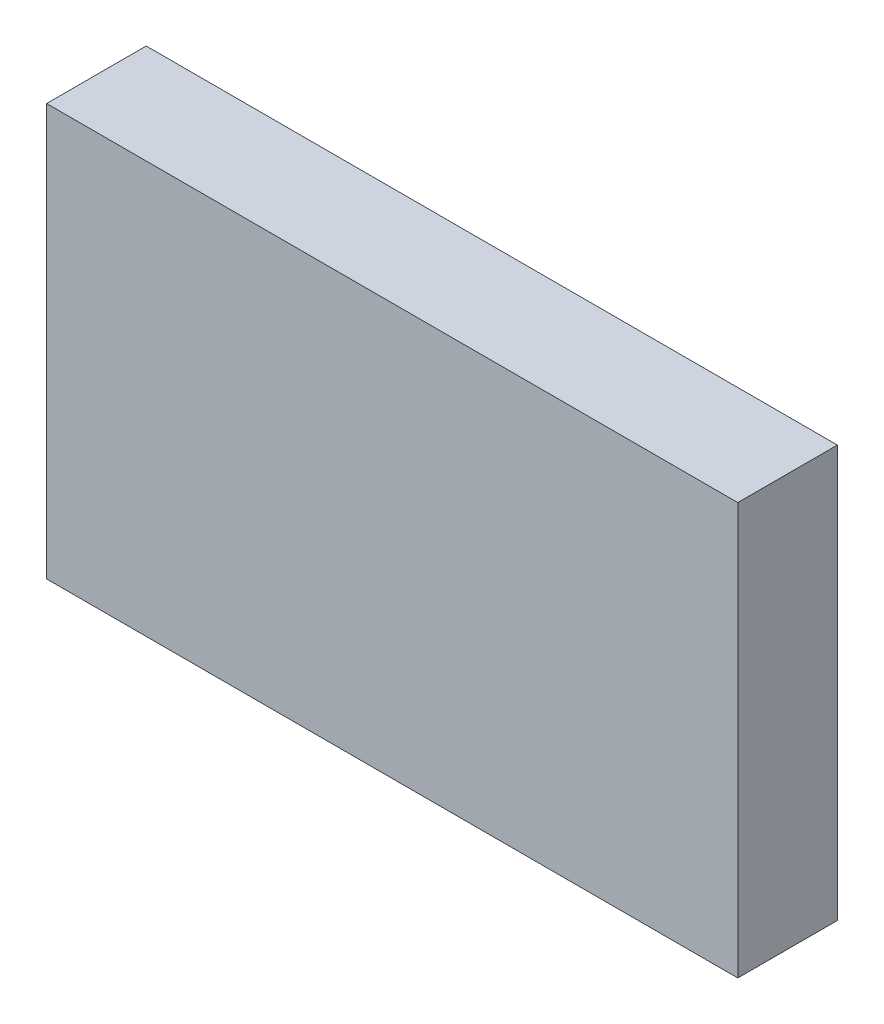
ISO-10303-21;
HEADER;
FILE_DESCRIPTION(('STEP AP214'),'2;1');
FILE_NAME('part.step','',(''),(''),'','','');
FILE_SCHEMA(('AUTOMOTIVE_DESIGN { 1 0 10303 214 1 1 1 1 }'));
ENDSEC;
DATA;
#1=APPLICATION_CONTEXT('core data for automotive mechanical design processes');
#2=APPLICATION_PROTOCOL_DEFINITION('international standard','automotive_design',2000,#1);
#3=PRODUCT_CONTEXT('',#1,'mechanical');
#4=PRODUCT('Part','Part','',(#3));
#5=PRODUCT_RELATED_PRODUCT_CATEGORY('part','',(#4));
#6=PRODUCT_DEFINITION_FORMATION('','',#4);
#7=PRODUCT_DEFINITION_CONTEXT('part definition',#1,'design');
#8=PRODUCT_DEFINITION('design','',#6,#7);
#9=PRODUCT_DEFINITION_SHAPE('','',#8);
#10=(LENGTH_UNIT() NAMED_UNIT(*) SI_UNIT(.MILLI.,.METRE.));
#11=(NAMED_UNIT(*) PLANE_ANGLE_UNIT() SI_UNIT($,.RADIAN.));
#12=(NAMED_UNIT(*) SI_UNIT($,.STERADIAN.) SOLID_ANGLE_UNIT());
#13=UNCERTAINTY_MEASURE_WITH_UNIT(LENGTH_MEASURE(1.E-05),#10,'distance_accuracy_value','');
#14=(GEOMETRIC_REPRESENTATION_CONTEXT(3) GLOBAL_UNCERTAINTY_ASSIGNED_CONTEXT((#13)) GLOBAL_UNIT_ASSIGNED_CONTEXT((#10,
#11,#12)) REPRESENTATION_CONTEXT('',''));
#15=CARTESIAN_POINT('',(0.,0.,0.));
#16=DIRECTION('',(0.,0.,1.));
#17=DIRECTION('',(1.,0.,0.));
#18=AXIS2_PLACEMENT_3D('',#15,#16,#17);
#19=CARTESIAN_POINT('',(0.,0.,0.));
#20=DIRECTION('',(1.,0.,0.));
#21=DIRECTION('',(0.,0.,1.));
#22=AXIS2_PLACEMENT_3D('',#19,#20,#21);
#23=PLANE('',#22);
#24=DIRECTION('',(0.,1.,0.));
#25=VECTOR('',#24,1.);
#26=CARTESIAN_POINT('',(0.,0.,0.735));
#27=LINE('',#26,#25);
#28=CARTESIAN_POINT('',(0.,0.,0.735));
#29=VERTEX_POINT('',#28);
#30=CARTESIAN_POINT('',(0.,3.038,0.735));
#31=VERTEX_POINT('',#30);
#32=EDGE_CURVE('E11',#29,#31,#27,.T.);
#33=ORIENTED_EDGE('',*,*,#32,.T.);
#34=DIRECTION('',(0.,0.,1.));
#35=VECTOR('',#34,1.);
#36=CARTESIAN_POINT('',(0.,3.038,0.));
#37=LINE('',#36,#35);
#38=CARTESIAN_POINT('',(0.,3.038,0.));
#39=VERTEX_POINT('',#38);
#40=EDGE_CURVE('E24',#39,#31,#37,.T.);
#41=ORIENTED_EDGE('',*,*,#40,.F.);
#42=DIRECTION('',(0.,1.,0.));
#43=VECTOR('',#42,1.);
#44=CARTESIAN_POINT('',(0.,0.,0.));
#45=LINE('',#44,#43);
#46=CARTESIAN_POINT('',(0.,0.,0.));
#47=VERTEX_POINT('',#46);
#48=EDGE_CURVE('E86',#47,#39,#45,.T.);
#49=ORIENTED_EDGE('',*,*,#48,.F.);
#50=DIRECTION('',(0.,0.,1.));
#51=VECTOR('',#50,1.);
#52=CARTESIAN_POINT('',(0.,0.,0.));
#53=LINE('',#52,#51);
#54=EDGE_CURVE('E36',#47,#29,#53,.T.);
#55=ORIENTED_EDGE('',*,*,#54,.T.);
#56=EDGE_LOOP('',(#33,#41,#49,#55));
#57=FACE_BOUND('',#56,.T.);
#58=ADVANCED_FACE('F17',(#57),#23,.F.);
#59=CARTESIAN_POINT('',(5.1,0.,0.));
#60=DIRECTION('',(1.,0.,0.));
#61=DIRECTION('',(0.,0.,1.));
#62=AXIS2_PLACEMENT_3D('',#59,#60,#61);
#63=PLANE('',#62);
#64=DIRECTION('',(0.,0.,1.));
#65=VECTOR('',#64,1.);
#66=CARTESIAN_POINT('',(5.1,0.,0.));
#67=LINE('',#66,#65);
#68=CARTESIAN_POINT('',(5.1,0.,0.));
#69=VERTEX_POINT('',#68);
#70=CARTESIAN_POINT('',(5.1,0.,0.735));
#71=VERTEX_POINT('',#70);
#72=EDGE_CURVE('E83',#69,#71,#67,.T.);
#73=ORIENTED_EDGE('',*,*,#72,.F.);
#74=DIRECTION('',(0.,1.,0.));
#75=VECTOR('',#74,1.);
#76=CARTESIAN_POINT('',(5.1,0.,0.));
#77=LINE('',#76,#75);
#78=CARTESIAN_POINT('',(5.1,3.038,0.));
#79=VERTEX_POINT('',#78);
#80=EDGE_CURVE('E63',#69,#79,#77,.T.);
#81=ORIENTED_EDGE('',*,*,#80,.T.);
#82=DIRECTION('',(0.,0.,1.));
#83=VECTOR('',#82,1.);
#84=CARTESIAN_POINT('',(5.1,3.038,0.));
#85=LINE('',#84,#83);
#86=CARTESIAN_POINT('',(5.1,3.038,0.735));
#87=VERTEX_POINT('',#86);
#88=EDGE_CURVE('E57',#79,#87,#85,.T.);
#89=ORIENTED_EDGE('',*,*,#88,.T.);
#90=DIRECTION('',(0.,1.,0.));
#91=VECTOR('',#90,1.);
#92=CARTESIAN_POINT('',(5.1,0.,0.735));
#93=LINE('',#92,#91);
#94=EDGE_CURVE('E60',#71,#87,#93,.T.);
#95=ORIENTED_EDGE('',*,*,#94,.F.);
#96=EDGE_LOOP('',(#73,#81,#89,#95));
#97=FACE_BOUND('',#96,.T.);
#98=ADVANCED_FACE('F59',(#97),#63,.T.);
#99=CARTESIAN_POINT('',(0.,0.,0.));
#100=DIRECTION('',(0.,1.,0.));
#101=DIRECTION('',(0.,0.,1.));
#102=AXIS2_PLACEMENT_3D('',#99,#100,#101);
#103=PLANE('',#102);
#104=ORIENTED_EDGE('',*,*,#72,.T.);
#105=DIRECTION('',(1.,0.,0.));
#106=VECTOR('',#105,1.);
#107=CARTESIAN_POINT('',(0.,0.,0.735));
#108=LINE('',#107,#106);
#109=EDGE_CURVE('E71',#29,#71,#108,.T.);
#110=ORIENTED_EDGE('',*,*,#109,.F.);
#111=ORIENTED_EDGE('',*,*,#54,.F.);
#112=DIRECTION('',(1.,0.,0.));
#113=VECTOR('',#112,1.);
#114=CARTESIAN_POINT('',(0.,0.,0.));
#115=LINE('',#114,#113);
#116=EDGE_CURVE('E76',#47,#69,#115,.T.);
#117=ORIENTED_EDGE('',*,*,#116,.T.);
#118=EDGE_LOOP('',(#104,#110,#111,#117));
#119=FACE_BOUND('',#118,.T.);
#120=ADVANCED_FACE('F91',(#119),#103,.F.);
#121=CARTESIAN_POINT('',(0.,3.038,0.));
#122=DIRECTION('',(0.,1.,0.));
#123=DIRECTION('',(0.,0.,1.));
#124=AXIS2_PLACEMENT_3D('',#121,#122,#123);
#125=PLANE('',#124);
#126=DIRECTION('',(1.,0.,0.));
#127=VECTOR('',#126,1.);
#128=CARTESIAN_POINT('',(0.,3.038,0.));
#129=LINE('',#128,#127);
#130=EDGE_CURVE('E74',#39,#79,#129,.T.);
#131=ORIENTED_EDGE('',*,*,#130,.F.);
#132=ORIENTED_EDGE('',*,*,#40,.T.);
#133=DIRECTION('',(1.,0.,0.));
#134=VECTOR('',#133,1.);
#135=CARTESIAN_POINT('',(0.,3.038,0.735));
#136=LINE('',#135,#134);
#137=EDGE_CURVE('E69',#31,#87,#136,.T.);
#138=ORIENTED_EDGE('',*,*,#137,.T.);
#139=ORIENTED_EDGE('',*,*,#88,.F.);
#140=EDGE_LOOP('',(#131,#132,#138,#139));
#141=FACE_BOUND('',#140,.T.);
#142=ADVANCED_FACE('F73',(#141),#125,.T.);
#143=CARTESIAN_POINT('',(0.,0.,0.));
#144=DIRECTION('',(0.,0.,1.));
#145=DIRECTION('',(1.,0.,0.));
#146=AXIS2_PLACEMENT_3D('',#143,#144,#145);
#147=PLANE('',#146);
#148=ORIENTED_EDGE('',*,*,#130,.T.);
#149=ORIENTED_EDGE('',*,*,#80,.F.);
#150=ORIENTED_EDGE('',*,*,#116,.F.);
#151=ORIENTED_EDGE('',*,*,#48,.T.);
#152=EDGE_LOOP('',(#148,#149,#150,#151));
#153=FACE_BOUND('',#152,.T.);
#154=ADVANCED_FACE('F89',(#153),#147,.F.);
#155=CARTESIAN_POINT('',(0.,0.,0.735));
#156=DIRECTION('',(0.,0.,1.));
#157=DIRECTION('',(1.,0.,0.));
#158=AXIS2_PLACEMENT_3D('',#155,#156,#157);
#159=PLANE('',#158);
#160=ORIENTED_EDGE('',*,*,#32,.F.);
#161=ORIENTED_EDGE('',*,*,#109,.T.);
#162=ORIENTED_EDGE('',*,*,#94,.T.);
#163=ORIENTED_EDGE('',*,*,#137,.F.);
#164=EDGE_LOOP('',(#160,#161,#162,#163));
#165=FACE_BOUND('',#164,.T.);
#166=ADVANCED_FACE('F68',(#165),#159,.T.);
#167=CLOSED_SHELL('',(#58,#98,#120,#142,#154,#166));
#168=MANIFOLD_SOLID_BREP('B1',#167);
#169=ADVANCED_BREP_SHAPE_REPRESENTATION('',(#18,#168),#14);
#170=SHAPE_DEFINITION_REPRESENTATION(#9,#169);
ENDSEC;
END-ISO-10303-21;
